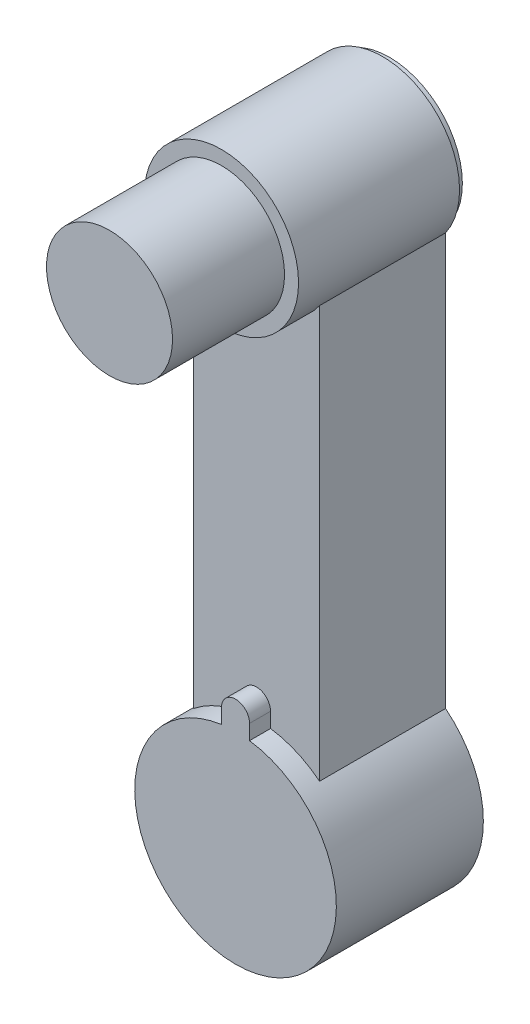
ISO-10303-21;
HEADER;
FILE_DESCRIPTION(('STEP AP214'),'2;1');
FILE_NAME('part.step','',(''),(''),'','','');
FILE_SCHEMA(('AUTOMOTIVE_DESIGN { 1 0 10303 214 1 1 1 1 }'));
ENDSEC;
DATA;
#1=APPLICATION_CONTEXT('core data for automotive mechanical design processes');
#2=APPLICATION_PROTOCOL_DEFINITION('international standard','automotive_design',2000,#1);
#3=PRODUCT_CONTEXT('',#1,'mechanical');
#4=PRODUCT('Part','Part','',(#3));
#5=PRODUCT_RELATED_PRODUCT_CATEGORY('part','',(#4));
#6=PRODUCT_DEFINITION_FORMATION('','',#4);
#7=PRODUCT_DEFINITION_CONTEXT('part definition',#1,'design');
#8=PRODUCT_DEFINITION('design','',#6,#7);
#9=PRODUCT_DEFINITION_SHAPE('','',#8);
#10=(LENGTH_UNIT() NAMED_UNIT(*) SI_UNIT(.MILLI.,.METRE.));
#11=(NAMED_UNIT(*) PLANE_ANGLE_UNIT() SI_UNIT($,.RADIAN.));
#12=(NAMED_UNIT(*) SI_UNIT($,.STERADIAN.) SOLID_ANGLE_UNIT());
#13=UNCERTAINTY_MEASURE_WITH_UNIT(LENGTH_MEASURE(1.E-05),#10,'distance_accuracy_value','');
#14=(GEOMETRIC_REPRESENTATION_CONTEXT(3) GLOBAL_UNCERTAINTY_ASSIGNED_CONTEXT((#13)) GLOBAL_UNIT_ASSIGNED_CONTEXT((#10,
#11,#12)) REPRESENTATION_CONTEXT('',''));
#15=CARTESIAN_POINT('',(0.,0.,0.));
#16=DIRECTION('',(0.,0.,1.));
#17=DIRECTION('',(1.,0.,0.));
#18=AXIS2_PLACEMENT_3D('',#15,#16,#17);
#19=CARTESIAN_POINT('',(0.,0.,105.));
#20=DIRECTION('',(0.,0.,-1.));
#21=DIRECTION('',(-1.,0.,0.));
#22=AXIS2_PLACEMENT_3D('',#19,#20,#21);
#23=CYLINDRICAL_SURFACE('',#22,72.);
#24=DIRECTION('',(0.,0.,-1.));
#25=VECTOR('',#24,1.);
#26=CARTESIAN_POINT('',(-9.99999999999999,71.3021738799035,105.));
#27=LINE('',#26,#25);
#28=CARTESIAN_POINT('',(-9.99999999999997,71.3021738799035,105.));
#29=VERTEX_POINT('',#28);
#30=CARTESIAN_POINT('',(-9.99999999999999,71.3021738799035,90.));
#31=VERTEX_POINT('',#30);
#32=EDGE_CURVE('E50',#29,#31,#27,.T.);
#33=ORIENTED_EDGE('',*,*,#32,.T.);
#34=CARTESIAN_POINT('',(0.,0.,90.));
#35=DIRECTION('',(0.,0.,1.));
#36=DIRECTION('',(1.,0.,0.));
#37=AXIS2_PLACEMENT_3D('',#34,#35,#36);
#38=CIRCLE('',#37,72.);
#39=CARTESIAN_POINT('',(-45.,56.2049819855856,90.));
#40=VERTEX_POINT('',#39);
#41=EDGE_CURVE('E138',#31,#40,#38,.T.);
#42=ORIENTED_EDGE('',*,*,#41,.T.);
#43=DIRECTION('',(0.,0.,-1.));
#44=VECTOR('',#43,1.);
#45=CARTESIAN_POINT('',(-45.,56.2049819855856,90.));
#46=LINE('',#45,#44);
#47=CARTESIAN_POINT('',(-45.,56.2049819855856,0.));
#48=VERTEX_POINT('',#47);
#49=EDGE_CURVE('E151',#40,#48,#46,.T.);
#50=ORIENTED_EDGE('',*,*,#49,.T.);
#51=CARTESIAN_POINT('',(0.,0.,0.));
#52=DIRECTION('',(0.,0.,1.));
#53=DIRECTION('',(1.,0.,0.));
#54=AXIS2_PLACEMENT_3D('',#51,#52,#53);
#55=CIRCLE('',#54,72.);
#56=CARTESIAN_POINT('',(45.,56.2049819855856,0.));
#57=VERTEX_POINT('',#56);
#58=EDGE_CURVE('E122',#48,#57,#55,.T.);
#59=ORIENTED_EDGE('',*,*,#58,.T.);
#60=DIRECTION('',(0.,0.,-1.));
#61=VECTOR('',#60,1.);
#62=CARTESIAN_POINT('',(45.,56.2049819855856,90.));
#63=LINE('',#62,#61);
#64=CARTESIAN_POINT('',(45.,56.2049819855856,90.));
#65=VERTEX_POINT('',#64);
#66=EDGE_CURVE('E148',#65,#57,#63,.T.);
#67=ORIENTED_EDGE('',*,*,#66,.F.);
#68=CARTESIAN_POINT('',(9.99999999999999,71.3021738799035,90.));
#69=VERTEX_POINT('',#68);
#70=EDGE_CURVE('E119',#65,#69,#38,.T.);
#71=ORIENTED_EDGE('',*,*,#70,.T.);
#72=DIRECTION('',(0.,0.,-1.));
#73=VECTOR('',#72,1.);
#74=CARTESIAN_POINT('',(9.99999999999999,71.3021738799035,105.));
#75=LINE('',#74,#73);
#76=CARTESIAN_POINT('',(9.99999999999999,71.3021738799035,105.));
#77=VERTEX_POINT('',#76);
#78=EDGE_CURVE('E104',#77,#69,#75,.T.);
#79=ORIENTED_EDGE('',*,*,#78,.F.);
#80=CARTESIAN_POINT('',(0.,0.,105.));
#81=DIRECTION('',(0.,0.,1.));
#82=DIRECTION('',(1.,0.,0.));
#83=AXIS2_PLACEMENT_3D('',#80,#81,#82);
#84=CIRCLE('',#83,72.);
#85=EDGE_CURVE('E117',#29,#77,#84,.T.);
#86=ORIENTED_EDGE('',*,*,#85,.F.);
#87=EDGE_LOOP('',(#33,#42,#50,#59,#67,#71,#79,#86));
#88=FACE_BOUND('',#87,.T.);
#89=ADVANCED_FACE('F35',(#88),#23,.T.);
#90=CARTESIAN_POINT('',(-45.,0.,90.));
#91=DIRECTION('',(-1.,0.,0.));
#92=DIRECTION('',(0.,0.,1.));
#93=AXIS2_PLACEMENT_3D('',#90,#91,#92);
#94=PLANE('',#93);
#95=DIRECTION('',(0.,1.,0.));
#96=VECTOR('',#95,1.);
#97=CARTESIAN_POINT('',(-45.,0.,0.));
#98=LINE('',#97,#96);
#99=CARTESIAN_POINT('',(-45.,350.377223398316,0.));
#100=VERTEX_POINT('',#99);
#101=EDGE_CURVE('E130',#48,#100,#98,.T.);
#102=ORIENTED_EDGE('',*,*,#101,.F.);
#103=ORIENTED_EDGE('',*,*,#49,.F.);
#104=DIRECTION('',(0.,1.,0.));
#105=VECTOR('',#104,1.);
#106=CARTESIAN_POINT('',(-45.,0.,90.));
#107=LINE('',#106,#105);
#108=CARTESIAN_POINT('',(-45.,350.377223398316,90.));
#109=VERTEX_POINT('',#108);
#110=EDGE_CURVE('E134',#40,#109,#107,.T.);
#111=ORIENTED_EDGE('',*,*,#110,.T.);
#112=DIRECTION('',(0.,0.,-1.));
#113=VECTOR('',#112,1.);
#114=CARTESIAN_POINT('',(-45.,350.377223398316,90.));
#115=LINE('',#114,#113);
#116=EDGE_CURVE('E153',#109,#100,#115,.T.);
#117=ORIENTED_EDGE('',*,*,#116,.T.);
#118=EDGE_LOOP('',(#102,#103,#111,#117));
#119=FACE_BOUND('',#118,.T.);
#120=ADVANCED_FACE('F37',(#119),#94,.T.);
#121=CARTESIAN_POINT('',(45.,0.,90.));
#122=DIRECTION('',(-1.,0.,0.));
#123=DIRECTION('',(0.,0.,1.));
#124=AXIS2_PLACEMENT_3D('',#121,#122,#123);
#125=PLANE('',#124);
#126=DIRECTION('',(0.,1.,0.));
#127=VECTOR('',#126,1.);
#128=CARTESIAN_POINT('',(45.,0.,0.));
#129=LINE('',#128,#127);
#130=CARTESIAN_POINT('',(45.,350.377223398316,0.));
#131=VERTEX_POINT('',#130);
#132=EDGE_CURVE('E135',#57,#131,#129,.T.);
#133=ORIENTED_EDGE('',*,*,#132,.T.);
#134=DIRECTION('',(0.,0.,-1.));
#135=VECTOR('',#134,1.);
#136=CARTESIAN_POINT('',(45.,350.377223398316,90.));
#137=LINE('',#136,#135);
#138=CARTESIAN_POINT('',(45.,350.377223398316,90.));
#139=VERTEX_POINT('',#138);
#140=EDGE_CURVE('E143',#139,#131,#137,.T.);
#141=ORIENTED_EDGE('',*,*,#140,.F.);
#142=DIRECTION('',(0.,1.,0.));
#143=VECTOR('',#142,1.);
#144=CARTESIAN_POINT('',(45.,0.,90.));
#145=LINE('',#144,#143);
#146=EDGE_CURVE('E140',#65,#139,#145,.T.);
#147=ORIENTED_EDGE('',*,*,#146,.F.);
#148=ORIENTED_EDGE('',*,*,#66,.T.);
#149=EDGE_LOOP('',(#133,#141,#147,#148));
#150=FACE_BOUND('',#149,.T.);
#151=ADVANCED_FACE('F194',(#150),#125,.F.);
#152=CARTESIAN_POINT('',(0.,0.,90.));
#153=DIRECTION('',(0.,0.,1.));
#154=DIRECTION('',(1.,0.,0.));
#155=AXIS2_PLACEMENT_3D('',#152,#153,#154);
#156=PLANE('',#155);
#157=ORIENTED_EDGE('',*,*,#41,.F.);
#158=DIRECTION('',(0.,-1.,0.));
#159=VECTOR('',#158,1.);
#160=CARTESIAN_POINT('',(-9.99999999999999,82.,90.));
#161=LINE('',#160,#159);
#162=CARTESIAN_POINT('',(-9.99999999999999,82.,90.));
#163=VERTEX_POINT('',#162);
#164=EDGE_CURVE('E169',#163,#31,#161,.T.);
#165=ORIENTED_EDGE('',*,*,#164,.F.);
#166=CARTESIAN_POINT('',(0.,82.,90.));
#167=DIRECTION('',(0.,0.,1.));
#168=DIRECTION('',(1.,0.,0.));
#169=AXIS2_PLACEMENT_3D('',#166,#167,#168);
#170=CIRCLE('',#169,9.99999999999999);
#171=CARTESIAN_POINT('',(9.99999999999999,82.,90.));
#172=VERTEX_POINT('',#171);
#173=EDGE_CURVE('E165',#172,#163,#170,.T.);
#174=ORIENTED_EDGE('',*,*,#173,.F.);
#175=DIRECTION('',(0.,1.,0.));
#176=VECTOR('',#175,1.);
#177=CARTESIAN_POINT('',(9.99999999999999,82.,90.));
#178=LINE('',#177,#176);
#179=EDGE_CURVE('E171',#69,#172,#178,.T.);
#180=ORIENTED_EDGE('',*,*,#179,.F.);
#181=ORIENTED_EDGE('',*,*,#70,.F.);
#182=ORIENTED_EDGE('',*,*,#146,.T.);
#183=CARTESIAN_POINT('',(0.,382.,90.));
#184=DIRECTION('',(0.,0.,1.));
#185=DIRECTION('',(1.,0.,0.));
#186=AXIS2_PLACEMENT_3D('',#183,#184,#185);
#187=CIRCLE('',#186,55.);
#188=EDGE_CURVE('E132',#109,#139,#187,.T.);
#189=ORIENTED_EDGE('',*,*,#188,.F.);
#190=ORIENTED_EDGE('',*,*,#110,.F.);
#191=EDGE_LOOP('',(#157,#165,#174,#180,#181,#182,#189,#190));
#192=FACE_BOUND('',#191,.T.);
#193=ADVANCED_FACE('F183',(#192),#156,.T.);
#194=CARTESIAN_POINT('',(0.,0.,0.));
#195=DIRECTION('',(0.,0.,1.));
#196=DIRECTION('',(1.,0.,0.));
#197=AXIS2_PLACEMENT_3D('',#194,#195,#196);
#198=PLANE('',#197);
#199=CARTESIAN_POINT('',(0.,382.,0.));
#200=DIRECTION('',(0.,0.,1.));
#201=DIRECTION('',(1.,0.,0.));
#202=AXIS2_PLACEMENT_3D('',#199,#200,#201);
#203=CIRCLE('',#202,52.);
#204=CARTESIAN_POINT('',(52.,382.,0.));
#205=VERTEX_POINT('',#204);
#206=EDGE_CURVE('E11',#205,#205,#203,.F.);
#207=ORIENTED_EDGE('',*,*,#206,.F.);
#208=EDGE_LOOP('',(#207));
#209=FACE_BOUND('',#208,.T.);
#210=ORIENTED_EDGE('',*,*,#101,.T.);
#211=CARTESIAN_POINT('',(0.,382.,0.));
#212=DIRECTION('',(0.,0.,1.));
#213=DIRECTION('',(1.,0.,0.));
#214=AXIS2_PLACEMENT_3D('',#211,#212,#213);
#215=CIRCLE('',#214,55.);
#216=EDGE_CURVE('E58',#131,#100,#215,.T.);
#217=ORIENTED_EDGE('',*,*,#216,.F.);
#218=ORIENTED_EDGE('',*,*,#132,.F.);
#219=ORIENTED_EDGE('',*,*,#58,.F.);
#220=EDGE_LOOP('',(#210,#217,#218,#219));
#221=FACE_BOUND('',#220,.T.);
#222=ADVANCED_FACE('F195',(#209,#221),#198,.F.);
#223=CARTESIAN_POINT('',(0.,382.,115.));
#224=DIRECTION('',(0.,0.,-1.));
#225=DIRECTION('',(-1.,0.,0.));
#226=AXIS2_PLACEMENT_3D('',#223,#224,#225);
#227=CYLINDRICAL_SURFACE('',#226,55.);
#228=ORIENTED_EDGE('',*,*,#116,.F.);
#229=ORIENTED_EDGE('',*,*,#188,.T.);
#230=ORIENTED_EDGE('',*,*,#140,.T.);
#231=ORIENTED_EDGE('',*,*,#216,.T.);
#232=EDGE_LOOP('',(#228,#229,#230,#231));
#233=FACE_BOUND('',#232,.T.);
#234=CARTESIAN_POINT('',(0.,382.,115.));
#235=DIRECTION('',(0.,0.,1.));
#236=DIRECTION('',(1.,0.,0.));
#237=AXIS2_PLACEMENT_3D('',#234,#235,#236);
#238=CIRCLE('',#237,55.);
#239=CARTESIAN_POINT('',(55.,382.,115.));
#240=VERTEX_POINT('',#239);
#241=EDGE_CURVE('E124',#240,#240,#238,.T.);
#242=ORIENTED_EDGE('',*,*,#241,.F.);
#243=EDGE_LOOP('',(#242));
#244=FACE_BOUND('',#243,.T.);
#245=ADVANCED_FACE('F191',(#233,#244),#227,.T.);
#246=CARTESIAN_POINT('',(0.,0.,115.));
#247=DIRECTION('',(0.,0.,1.));
#248=DIRECTION('',(1.,0.,0.));
#249=AXIS2_PLACEMENT_3D('',#246,#247,#248);
#250=PLANE('',#249);
#251=CARTESIAN_POINT('',(0.,382.,115.));
#252=DIRECTION('',(0.,0.,1.));
#253=DIRECTION('',(1.,0.,0.));
#254=AXIS2_PLACEMENT_3D('',#251,#252,#253);
#255=CIRCLE('',#254,45.);
#256=CARTESIAN_POINT('',(45.,382.,115.));
#257=VERTEX_POINT('',#256);
#258=EDGE_CURVE('E43',#257,#257,#255,.T.);
#259=ORIENTED_EDGE('',*,*,#258,.F.);
#260=EDGE_LOOP('',(#259));
#261=FACE_BOUND('',#260,.T.);
#262=ORIENTED_EDGE('',*,*,#241,.T.);
#263=EDGE_LOOP('',(#262));
#264=FACE_BOUND('',#263,.T.);
#265=ADVANCED_FACE('F203',(#261,#264),#250,.T.);
#266=CARTESIAN_POINT('',(0.,0.,105.));
#267=DIRECTION('',(0.,0.,1.));
#268=DIRECTION('',(1.,0.,0.));
#269=AXIS2_PLACEMENT_3D('',#266,#267,#268);
#270=PLANE('',#269);
#271=ORIENTED_EDGE('',*,*,#85,.T.);
#272=DIRECTION('',(0.,1.,0.));
#273=VECTOR('',#272,1.);
#274=CARTESIAN_POINT('',(9.99999999999999,82.,105.));
#275=LINE('',#274,#273);
#276=CARTESIAN_POINT('',(9.99999999999999,82.,105.));
#277=VERTEX_POINT('',#276);
#278=EDGE_CURVE('E101',#77,#277,#275,.T.);
#279=ORIENTED_EDGE('',*,*,#278,.T.);
#280=CARTESIAN_POINT('',(0.,82.,105.));
#281=DIRECTION('',(0.,0.,1.));
#282=DIRECTION('',(1.,0.,0.));
#283=AXIS2_PLACEMENT_3D('',#280,#281,#282);
#284=CIRCLE('',#283,9.99999999999999);
#285=CARTESIAN_POINT('',(-9.99999999999999,82.,105.));
#286=VERTEX_POINT('',#285);
#287=EDGE_CURVE('E111',#277,#286,#284,.T.);
#288=ORIENTED_EDGE('',*,*,#287,.T.);
#289=DIRECTION('',(0.,-1.,0.));
#290=VECTOR('',#289,1.);
#291=CARTESIAN_POINT('',(-9.99999999999999,82.,105.));
#292=LINE('',#291,#290);
#293=EDGE_CURVE('E112',#286,#29,#292,.T.);
#294=ORIENTED_EDGE('',*,*,#293,.T.);
#295=EDGE_LOOP('',(#271,#279,#288,#294));
#296=FACE_BOUND('',#295,.T.);
#297=ADVANCED_FACE('F121',(#296),#270,.T.);
#298=CARTESIAN_POINT('',(-9.99999999999999,82.,105.));
#299=DIRECTION('',(1.,0.,0.));
#300=DIRECTION('',(0.,0.,-1.));
#301=AXIS2_PLACEMENT_3D('',#298,#299,#300);
#302=PLANE('',#301);
#303=ORIENTED_EDGE('',*,*,#164,.T.);
#304=ORIENTED_EDGE('',*,*,#32,.F.);
#305=ORIENTED_EDGE('',*,*,#293,.F.);
#306=DIRECTION('',(0.,0.,-1.));
#307=VECTOR('',#306,1.);
#308=CARTESIAN_POINT('',(-9.99999999999999,82.,105.));
#309=LINE('',#308,#307);
#310=EDGE_CURVE('E168',#286,#163,#309,.T.);
#311=ORIENTED_EDGE('',*,*,#310,.T.);
#312=EDGE_LOOP('',(#303,#304,#305,#311));
#313=FACE_BOUND('',#312,.T.);
#314=ADVANCED_FACE('F185',(#313),#302,.F.);
#315=CARTESIAN_POINT('',(9.99999999999999,82.,105.));
#316=DIRECTION('',(-1.,0.,0.));
#317=DIRECTION('',(0.,0.,1.));
#318=AXIS2_PLACEMENT_3D('',#315,#316,#317);
#319=PLANE('',#318);
#320=ORIENTED_EDGE('',*,*,#179,.T.);
#321=DIRECTION('',(0.,0.,-1.));
#322=VECTOR('',#321,1.);
#323=CARTESIAN_POINT('',(9.99999999999999,82.,105.));
#324=LINE('',#323,#322);
#325=EDGE_CURVE('E107',#277,#172,#324,.T.);
#326=ORIENTED_EDGE('',*,*,#325,.F.);
#327=ORIENTED_EDGE('',*,*,#278,.F.);
#328=ORIENTED_EDGE('',*,*,#78,.T.);
#329=EDGE_LOOP('',(#320,#326,#327,#328));
#330=FACE_BOUND('',#329,.T.);
#331=ADVANCED_FACE('F103',(#330),#319,.F.);
#332=CARTESIAN_POINT('',(0.,82.,105.));
#333=DIRECTION('',(0.,0.,-1.));
#334=DIRECTION('',(-1.,0.,0.));
#335=AXIS2_PLACEMENT_3D('',#332,#333,#334);
#336=CYLINDRICAL_SURFACE('',#335,9.99999999999999);
#337=ORIENTED_EDGE('',*,*,#173,.T.);
#338=ORIENTED_EDGE('',*,*,#310,.F.);
#339=ORIENTED_EDGE('',*,*,#287,.F.);
#340=ORIENTED_EDGE('',*,*,#325,.T.);
#341=EDGE_LOOP('',(#337,#338,#339,#340));
#342=FACE_BOUND('',#341,.T.);
#343=ADVANCED_FACE('F178',(#342),#336,.T.);
#344=CARTESIAN_POINT('',(0.,382.,195.));
#345=DIRECTION('',(0.,0.,-1.));
#346=DIRECTION('',(-1.,0.,0.));
#347=AXIS2_PLACEMENT_3D('',#344,#345,#346);
#348=CYLINDRICAL_SURFACE('',#347,45.);
#349=CARTESIAN_POINT('',(0.,382.,195.));
#350=DIRECTION('',(0.,0.,1.));
#351=DIRECTION('',(1.,0.,0.));
#352=AXIS2_PLACEMENT_3D('',#349,#350,#351);
#353=CIRCLE('',#352,45.);
#354=CARTESIAN_POINT('',(45.,382.,195.));
#355=VERTEX_POINT('',#354);
#356=EDGE_CURVE('E163',#355,#355,#353,.T.);
#357=ORIENTED_EDGE('',*,*,#356,.F.);
#358=EDGE_LOOP('',(#357));
#359=FACE_BOUND('',#358,.T.);
#360=ORIENTED_EDGE('',*,*,#258,.T.);
#361=EDGE_LOOP('',(#360));
#362=FACE_BOUND('',#361,.T.);
#363=ADVANCED_FACE('F232',(#359,#362),#348,.T.);
#364=CARTESIAN_POINT('',(0.,382.,195.));
#365=DIRECTION('',(0.,0.,1.));
#366=DIRECTION('',(1.,0.,0.));
#367=AXIS2_PLACEMENT_3D('',#364,#365,#366);
#368=PLANE('',#367);
#369=ORIENTED_EDGE('',*,*,#356,.T.);
#370=EDGE_LOOP('',(#369));
#371=FACE_BOUND('',#370,.T.);
#372=ADVANCED_FACE('F235',(#371),#368,.T.);
#373=CARTESIAN_POINT('',(0.,382.,-5.));
#374=DIRECTION('',(0.,0.,1.));
#375=DIRECTION('',(1.,0.,0.));
#376=AXIS2_PLACEMENT_3D('',#373,#374,#375);
#377=CYLINDRICAL_SURFACE('',#376,52.);
#378=CARTESIAN_POINT('',(0.,382.,-5.));
#379=DIRECTION('',(0.,0.,-1.));
#380=DIRECTION('',(-1.,0.,0.));
#381=AXIS2_PLACEMENT_3D('',#378,#379,#380);
#382=CIRCLE('',#381,52.);
#383=CARTESIAN_POINT('',(-52.,382.,-5.));
#384=VERTEX_POINT('',#383);
#385=EDGE_CURVE('E251',#384,#384,#382,.T.);
#386=ORIENTED_EDGE('',*,*,#385,.F.);
#387=EDGE_LOOP('',(#386));
#388=FACE_BOUND('',#387,.T.);
#389=ORIENTED_EDGE('',*,*,#206,.T.);
#390=EDGE_LOOP('',(#389));
#391=FACE_BOUND('',#390,.T.);
#392=ADVANCED_FACE('F239',(#388,#391),#377,.T.);
#393=CARTESIAN_POINT('',(0.,382.,-5.));
#394=DIRECTION('',(0.,0.,-1.));
#395=DIRECTION('',(-1.,0.,0.));
#396=AXIS2_PLACEMENT_3D('',#393,#394,#395);
#397=PLANE('',#396);
#398=ORIENTED_EDGE('',*,*,#385,.T.);
#399=EDGE_LOOP('',(#398));
#400=FACE_BOUND('',#399,.T.);
#401=ADVANCED_FACE('F243',(#400),#397,.T.);
#402=CLOSED_SHELL('',(#89,#120,#151,#193,#222,#245,#265,#297,#314,#331,#343,#363,#372,#392,#401));
#403=MANIFOLD_SOLID_BREP('B2',#402);
#404=ADVANCED_BREP_SHAPE_REPRESENTATION('',(#18,#403),#14);
#405=SHAPE_DEFINITION_REPRESENTATION(#9,#404);
ENDSEC;
END-ISO-10303-21;
